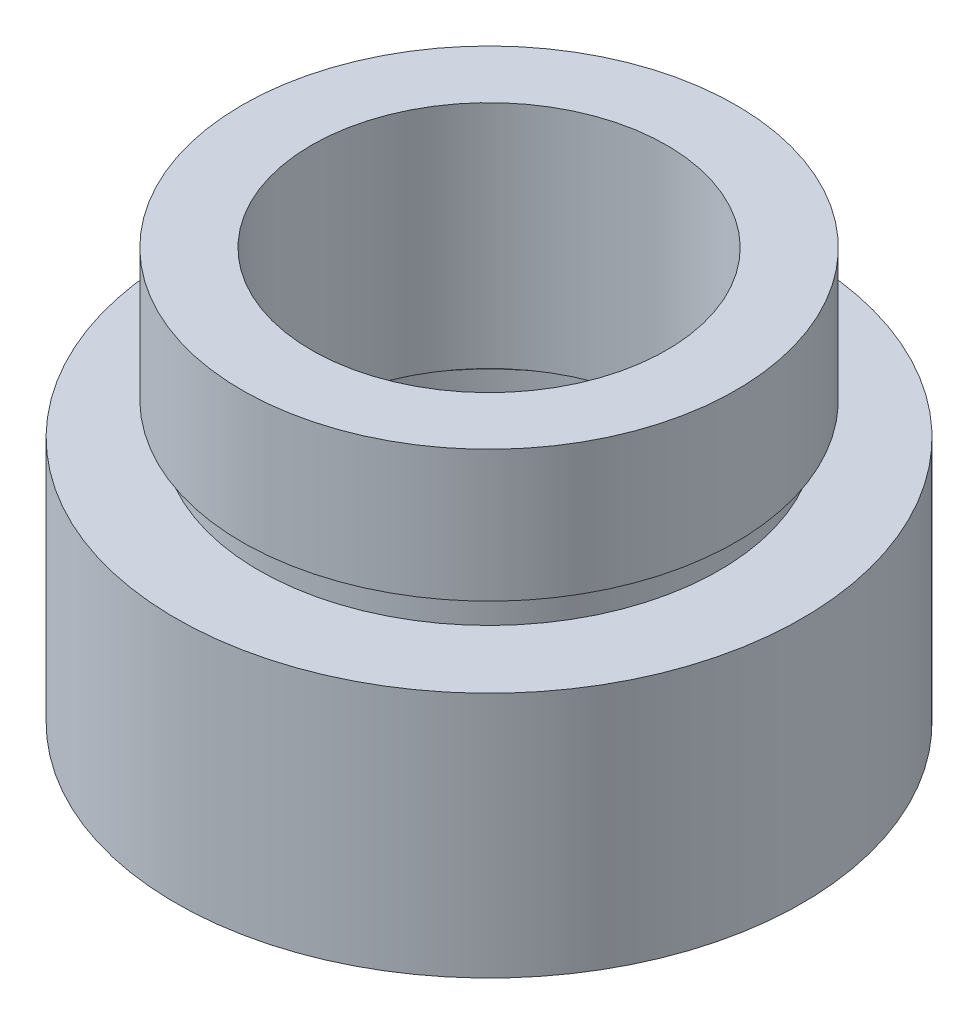
ISO-10303-21;
HEADER;
FILE_DESCRIPTION(('STEP AP214'),'2;1');
FILE_NAME('part.step','',(''),(''),'','','');
FILE_SCHEMA(('AUTOMOTIVE_DESIGN { 1 0 10303 214 1 1 1 1 }'));
ENDSEC;
DATA;
#1=APPLICATION_CONTEXT('core data for automotive mechanical design processes');
#2=APPLICATION_PROTOCOL_DEFINITION('international standard','automotive_design',2000,#1);
#3=PRODUCT_CONTEXT('',#1,'mechanical');
#4=PRODUCT('Part','Part','',(#3));
#5=PRODUCT_RELATED_PRODUCT_CATEGORY('part','',(#4));
#6=PRODUCT_DEFINITION_FORMATION('','',#4);
#7=PRODUCT_DEFINITION_CONTEXT('part definition',#1,'design');
#8=PRODUCT_DEFINITION('design','',#6,#7);
#9=PRODUCT_DEFINITION_SHAPE('','',#8);
#10=(LENGTH_UNIT() NAMED_UNIT(*) SI_UNIT(.MILLI.,.METRE.));
#11=(NAMED_UNIT(*) PLANE_ANGLE_UNIT() SI_UNIT($,.RADIAN.));
#12=(NAMED_UNIT(*) SI_UNIT($,.STERADIAN.) SOLID_ANGLE_UNIT());
#13=UNCERTAINTY_MEASURE_WITH_UNIT(LENGTH_MEASURE(1.E-05),#10,'distance_accuracy_value','');
#14=(GEOMETRIC_REPRESENTATION_CONTEXT(3) GLOBAL_UNCERTAINTY_ASSIGNED_CONTEXT((#13)) GLOBAL_UNIT_ASSIGNED_CONTEXT((#10,
#11,#12)) REPRESENTATION_CONTEXT('',''));
#15=CARTESIAN_POINT('',(0.,0.,0.));
#16=DIRECTION('',(0.,0.,1.));
#17=DIRECTION('',(1.,0.,0.));
#18=AXIS2_PLACEMENT_3D('',#15,#16,#17);
#19=CARTESIAN_POINT('',(9.52500000000001,0.,0.));
#20=DIRECTION('',(0.,1.,0.));
#21=DIRECTION('',(-1.,0.,0.));
#22=AXIS2_PLACEMENT_3D('',#19,#20,#21);
#23=PLANE('',#22);
#24=CARTESIAN_POINT('',(0.,0.,0.));
#25=DIRECTION('',(0.,1.,0.));
#26=DIRECTION('',(-1.,0.,0.));
#27=AXIS2_PLACEMENT_3D('',#24,#25,#26);
#28=CIRCLE('',#27,9.525);
#29=CARTESIAN_POINT('',(-9.525,0.,0.));
#30=VERTEX_POINT('',#29);
#31=EDGE_CURVE('E75',#30,#30,#28,.T.);
#32=ORIENTED_EDGE('',*,*,#31,.F.);
#33=EDGE_LOOP('',(#32));
#34=FACE_BOUND('',#33,.T.);
#35=CARTESIAN_POINT('',(0.,0.,0.));
#36=DIRECTION('',(0.,1.,0.));
#37=DIRECTION('',(-1.,0.,0.));
#38=AXIS2_PLACEMENT_3D('',#35,#36,#37);
#39=CIRCLE('',#38,6.795);
#40=CARTESIAN_POINT('',(-6.795,0.,0.));
#41=VERTEX_POINT('',#40);
#42=EDGE_CURVE('E10',#41,#41,#39,.T.);
#43=ORIENTED_EDGE('',*,*,#42,.T.);
#44=EDGE_LOOP('',(#43));
#45=FACE_BOUND('',#44,.T.);
#46=ADVANCED_FACE('F35',(#34,#45),#23,.F.);
#47=CARTESIAN_POINT('',(0.,16.8860182370821,0.));
#48=DIRECTION('',(0.,1.,0.));
#49=DIRECTION('',(-1.,0.,0.));
#50=AXIS2_PLACEMENT_3D('',#47,#48,#49);
#51=CYLINDRICAL_SURFACE('',#50,6.795);
#52=ORIENTED_EDGE('',*,*,#42,.F.);
#53=EDGE_LOOP('',(#52));
#54=FACE_BOUND('',#53,.T.);
#55=CARTESIAN_POINT('',(0.,4.5,0.));
#56=DIRECTION('',(0.,1.,0.));
#57=DIRECTION('',(-1.,0.,0.));
#58=AXIS2_PLACEMENT_3D('',#55,#56,#57);
#59=CIRCLE('',#58,6.795);
#60=CARTESIAN_POINT('',(-6.795,4.5,0.));
#61=VERTEX_POINT('',#60);
#62=EDGE_CURVE('E41',#61,#61,#59,.T.);
#63=ORIENTED_EDGE('',*,*,#62,.T.);
#64=EDGE_LOOP('',(#63));
#65=FACE_BOUND('',#64,.T.);
#66=ADVANCED_FACE('F82',(#54,#65),#51,.F.);
#67=CARTESIAN_POINT('',(6.795,4.5,0.));
#68=DIRECTION('',(0.,-1.,0.));
#69=DIRECTION('',(1.,0.,0.));
#70=AXIS2_PLACEMENT_3D('',#67,#68,#69);
#71=PLANE('',#70);
#72=ORIENTED_EDGE('',*,*,#62,.F.);
#73=EDGE_LOOP('',(#72));
#74=FACE_BOUND('',#73,.T.);
#75=CARTESIAN_POINT('',(0.,4.5,0.));
#76=DIRECTION('',(0.,1.,0.));
#77=DIRECTION('',(-1.,0.,0.));
#78=AXIS2_PLACEMENT_3D('',#75,#76,#77);
#79=CIRCLE('',#78,6.9);
#80=CARTESIAN_POINT('',(-6.9,4.5,0.));
#81=VERTEX_POINT('',#80);
#82=EDGE_CURVE('E45',#81,#81,#79,.T.);
#83=ORIENTED_EDGE('',*,*,#82,.T.);
#84=EDGE_LOOP('',(#83));
#85=FACE_BOUND('',#84,.T.);
#86=ADVANCED_FACE('F86',(#74,#85),#71,.F.);
#87=CARTESIAN_POINT('',(0.,16.8860182370821,0.));
#88=DIRECTION('',(0.,1.,0.));
#89=DIRECTION('',(-1.,0.,0.));
#90=AXIS2_PLACEMENT_3D('',#87,#88,#89);
#91=CYLINDRICAL_SURFACE('',#90,6.9);
#92=ORIENTED_EDGE('',*,*,#82,.F.);
#93=EDGE_LOOP('',(#92));
#94=FACE_BOUND('',#93,.T.);
#95=CARTESIAN_POINT('',(0.,5.5,0.));
#96=DIRECTION('',(0.,1.,0.));
#97=DIRECTION('',(-1.,0.,0.));
#98=AXIS2_PLACEMENT_3D('',#95,#96,#97);
#99=CIRCLE('',#98,6.9);
#100=CARTESIAN_POINT('',(-6.9,5.5,0.));
#101=VERTEX_POINT('',#100);
#102=EDGE_CURVE('E49',#101,#101,#99,.T.);
#103=ORIENTED_EDGE('',*,*,#102,.T.);
#104=EDGE_LOOP('',(#103));
#105=FACE_BOUND('',#104,.T.);
#106=ADVANCED_FACE('F91',(#94,#105),#91,.F.);
#107=CARTESIAN_POINT('',(5.4,5.5,0.));
#108=DIRECTION('',(0.,1.,0.));
#109=DIRECTION('',(-1.,0.,0.));
#110=AXIS2_PLACEMENT_3D('',#107,#108,#109);
#111=PLANE('',#110);
#112=ORIENTED_EDGE('',*,*,#102,.F.);
#113=EDGE_LOOP('',(#112));
#114=FACE_BOUND('',#113,.T.);
#115=CARTESIAN_POINT('',(0.,5.5,0.));
#116=DIRECTION('',(0.,1.,0.));
#117=DIRECTION('',(-1.,0.,0.));
#118=AXIS2_PLACEMENT_3D('',#115,#116,#117);
#119=CIRCLE('',#118,5.4);
#120=CARTESIAN_POINT('',(-5.4,5.5,0.));
#121=VERTEX_POINT('',#120);
#122=EDGE_CURVE('E54',#121,#121,#119,.T.);
#123=ORIENTED_EDGE('',*,*,#122,.T.);
#124=EDGE_LOOP('',(#123));
#125=FACE_BOUND('',#124,.T.);
#126=ADVANCED_FACE('F97',(#114,#125),#111,.F.);
#127=CARTESIAN_POINT('',(0.,16.8860182370821,0.));
#128=DIRECTION('',(0.,1.,0.));
#129=DIRECTION('',(-1.,0.,0.));
#130=AXIS2_PLACEMENT_3D('',#127,#128,#129);
#131=CYLINDRICAL_SURFACE('',#130,5.4);
#132=ORIENTED_EDGE('',*,*,#122,.F.);
#133=EDGE_LOOP('',(#132));
#134=FACE_BOUND('',#133,.T.);
#135=CARTESIAN_POINT('',(0.,12.5,0.));
#136=DIRECTION('',(0.,1.,0.));
#137=DIRECTION('',(-1.,0.,0.));
#138=AXIS2_PLACEMENT_3D('',#135,#136,#137);
#139=CIRCLE('',#138,5.4);
#140=CARTESIAN_POINT('',(-5.4,12.5,0.));
#141=VERTEX_POINT('',#140);
#142=EDGE_CURVE('E57',#141,#141,#139,.T.);
#143=ORIENTED_EDGE('',*,*,#142,.T.);
#144=EDGE_LOOP('',(#143));
#145=FACE_BOUND('',#144,.T.);
#146=ADVANCED_FACE('F101',(#134,#145),#131,.F.);
#147=CARTESIAN_POINT('',(5.4,12.5,0.));
#148=DIRECTION('',(0.,-1.,0.));
#149=DIRECTION('',(1.,0.,0.));
#150=AXIS2_PLACEMENT_3D('',#147,#148,#149);
#151=PLANE('',#150);
#152=ORIENTED_EDGE('',*,*,#142,.F.);
#153=EDGE_LOOP('',(#152));
#154=FACE_BOUND('',#153,.T.);
#155=CARTESIAN_POINT('',(0.,12.5,0.));
#156=DIRECTION('',(0.,1.,0.));
#157=DIRECTION('',(-1.,0.,0.));
#158=AXIS2_PLACEMENT_3D('',#155,#156,#157);
#159=CIRCLE('',#158,7.51);
#160=CARTESIAN_POINT('',(-7.51,12.5,0.));
#161=VERTEX_POINT('',#160);
#162=EDGE_CURVE('E60',#161,#161,#159,.T.);
#163=ORIENTED_EDGE('',*,*,#162,.T.);
#164=EDGE_LOOP('',(#163));
#165=FACE_BOUND('',#164,.T.);
#166=ADVANCED_FACE('F105',(#154,#165),#151,.F.);
#167=CARTESIAN_POINT('',(0.,16.8860182370821,0.));
#168=DIRECTION('',(0.,1.,0.));
#169=DIRECTION('',(-1.,0.,0.));
#170=AXIS2_PLACEMENT_3D('',#167,#168,#169);
#171=CYLINDRICAL_SURFACE('',#170,7.51);
#172=ORIENTED_EDGE('',*,*,#162,.F.);
#173=EDGE_LOOP('',(#172));
#174=FACE_BOUND('',#173,.T.);
#175=CARTESIAN_POINT('',(0.,8.5,0.));
#176=DIRECTION('',(0.,1.,0.));
#177=DIRECTION('',(-1.,0.,0.));
#178=AXIS2_PLACEMENT_3D('',#175,#176,#177);
#179=CIRCLE('',#178,7.51);
#180=CARTESIAN_POINT('',(-7.51,8.5,0.));
#181=VERTEX_POINT('',#180);
#182=EDGE_CURVE('E63',#181,#181,#179,.T.);
#183=ORIENTED_EDGE('',*,*,#182,.T.);
#184=EDGE_LOOP('',(#183));
#185=FACE_BOUND('',#184,.T.);
#186=ADVANCED_FACE('F109',(#174,#185),#171,.T.);
#187=CARTESIAN_POINT('',(7.51,8.5,0.));
#188=DIRECTION('',(0.,1.,0.));
#189=DIRECTION('',(-1.,0.,0.));
#190=AXIS2_PLACEMENT_3D('',#187,#188,#189);
#191=PLANE('',#190);
#192=ORIENTED_EDGE('',*,*,#182,.F.);
#193=EDGE_LOOP('',(#192));
#194=FACE_BOUND('',#193,.T.);
#195=CARTESIAN_POINT('',(0.,8.5,0.));
#196=DIRECTION('',(0.,1.,0.));
#197=DIRECTION('',(-1.,0.,0.));
#198=AXIS2_PLACEMENT_3D('',#195,#196,#197);
#199=CIRCLE('',#198,7.);
#200=CARTESIAN_POINT('',(-7.,8.5,0.));
#201=VERTEX_POINT('',#200);
#202=EDGE_CURVE('E66',#201,#201,#199,.T.);
#203=ORIENTED_EDGE('',*,*,#202,.T.);
#204=EDGE_LOOP('',(#203));
#205=FACE_BOUND('',#204,.T.);
#206=ADVANCED_FACE('F113',(#194,#205),#191,.F.);
#207=CARTESIAN_POINT('',(0.,16.8860182370821,0.));
#208=DIRECTION('',(0.,1.,0.));
#209=DIRECTION('',(-1.,0.,0.));
#210=AXIS2_PLACEMENT_3D('',#207,#208,#209);
#211=CYLINDRICAL_SURFACE('',#210,7.);
#212=ORIENTED_EDGE('',*,*,#202,.F.);
#213=EDGE_LOOP('',(#212));
#214=FACE_BOUND('',#213,.T.);
#215=CARTESIAN_POINT('',(0.,7.5,0.));
#216=DIRECTION('',(0.,1.,0.));
#217=DIRECTION('',(-1.,0.,0.));
#218=AXIS2_PLACEMENT_3D('',#215,#216,#217);
#219=CIRCLE('',#218,7.);
#220=CARTESIAN_POINT('',(-7.,7.5,0.));
#221=VERTEX_POINT('',#220);
#222=EDGE_CURVE('E69',#221,#221,#219,.T.);
#223=ORIENTED_EDGE('',*,*,#222,.T.);
#224=EDGE_LOOP('',(#223));
#225=FACE_BOUND('',#224,.T.);
#226=ADVANCED_FACE('F117',(#214,#225),#211,.T.);
#227=CARTESIAN_POINT('',(7.,7.5,0.));
#228=DIRECTION('',(0.,-1.,0.));
#229=DIRECTION('',(1.,0.,0.));
#230=AXIS2_PLACEMENT_3D('',#227,#228,#229);
#231=PLANE('',#230);
#232=ORIENTED_EDGE('',*,*,#222,.F.);
#233=EDGE_LOOP('',(#232));
#234=FACE_BOUND('',#233,.T.);
#235=CARTESIAN_POINT('',(0.,7.5,0.));
#236=DIRECTION('',(0.,1.,0.));
#237=DIRECTION('',(-1.,0.,0.));
#238=AXIS2_PLACEMENT_3D('',#235,#236,#237);
#239=CIRCLE('',#238,9.525);
#240=CARTESIAN_POINT('',(-9.525,7.5,0.));
#241=VERTEX_POINT('',#240);
#242=EDGE_CURVE('E72',#241,#241,#239,.T.);
#243=ORIENTED_EDGE('',*,*,#242,.T.);
#244=EDGE_LOOP('',(#243));
#245=FACE_BOUND('',#244,.T.);
#246=ADVANCED_FACE('F121',(#234,#245),#231,.F.);
#247=CARTESIAN_POINT('',(0.,16.8860182370821,0.));
#248=DIRECTION('',(0.,1.,0.));
#249=DIRECTION('',(-1.,0.,0.));
#250=AXIS2_PLACEMENT_3D('',#247,#248,#249);
#251=CYLINDRICAL_SURFACE('',#250,9.525);
#252=ORIENTED_EDGE('',*,*,#242,.F.);
#253=EDGE_LOOP('',(#252));
#254=FACE_BOUND('',#253,.T.);
#255=ORIENTED_EDGE('',*,*,#31,.T.);
#256=EDGE_LOOP('',(#255));
#257=FACE_BOUND('',#256,.T.);
#258=ADVANCED_FACE('F79',(#254,#257),#251,.T.);
#259=CLOSED_SHELL('',(#46,#66,#86,#106,#126,#146,#166,#186,#206,#226,#246,#258));
#260=MANIFOLD_SOLID_BREP('B2',#259);
#261=ADVANCED_BREP_SHAPE_REPRESENTATION('',(#18,#260),#14);
#262=SHAPE_DEFINITION_REPRESENTATION(#9,#261);
ENDSEC;
END-ISO-10303-21;
